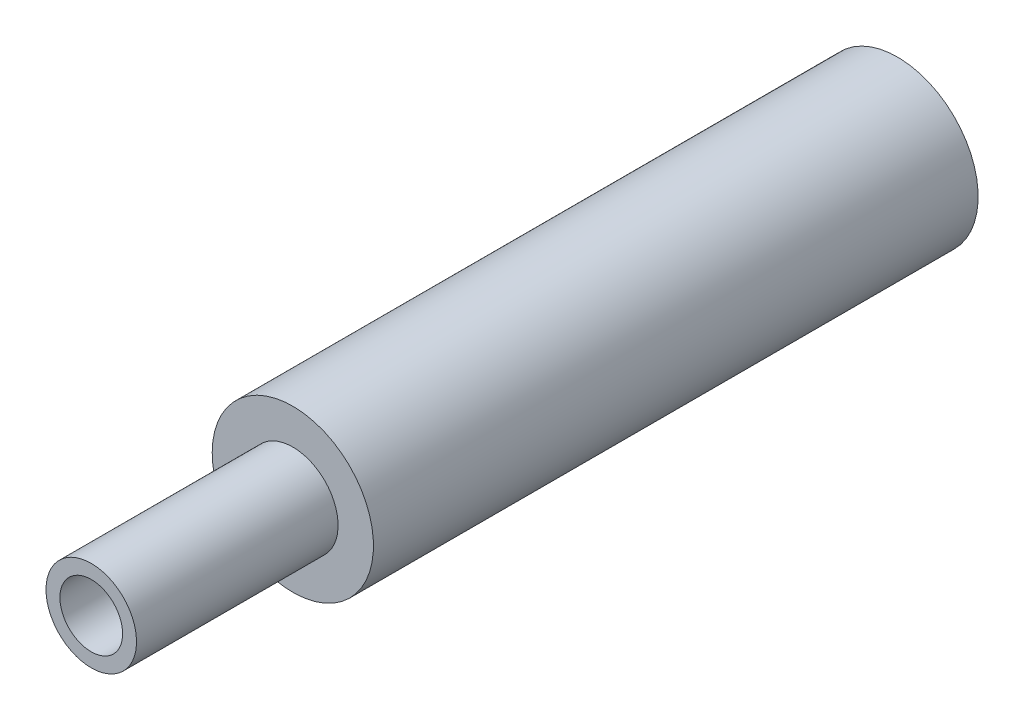
ISO-10303-21;
HEADER;
FILE_DESCRIPTION(('STEP AP214'),'2;1');
FILE_NAME('part.step','',(''),(''),'','','');
FILE_SCHEMA(('AUTOMOTIVE_DESIGN { 1 0 10303 214 1 1 1 1 }'));
ENDSEC;
DATA;
#1=APPLICATION_CONTEXT('core data for automotive mechanical design processes');
#2=APPLICATION_PROTOCOL_DEFINITION('international standard','automotive_design',2000,#1);
#3=PRODUCT_CONTEXT('',#1,'mechanical');
#4=PRODUCT('Part','Part','',(#3));
#5=PRODUCT_RELATED_PRODUCT_CATEGORY('part','',(#4));
#6=PRODUCT_DEFINITION_FORMATION('','',#4);
#7=PRODUCT_DEFINITION_CONTEXT('part definition',#1,'design');
#8=PRODUCT_DEFINITION('design','',#6,#7);
#9=PRODUCT_DEFINITION_SHAPE('','',#8);
#10=(LENGTH_UNIT() NAMED_UNIT(*) SI_UNIT(.MILLI.,.METRE.));
#11=(NAMED_UNIT(*) PLANE_ANGLE_UNIT() SI_UNIT($,.RADIAN.));
#12=(NAMED_UNIT(*) SI_UNIT($,.STERADIAN.) SOLID_ANGLE_UNIT());
#13=UNCERTAINTY_MEASURE_WITH_UNIT(LENGTH_MEASURE(1.E-05),#10,'distance_accuracy_value','');
#14=(GEOMETRIC_REPRESENTATION_CONTEXT(3) GLOBAL_UNCERTAINTY_ASSIGNED_CONTEXT((#13)) GLOBAL_UNIT_ASSIGNED_CONTEXT((#10,
#11,#12)) REPRESENTATION_CONTEXT('',''));
#15=CARTESIAN_POINT('',(0.,0.,0.));
#16=DIRECTION('',(0.,0.,1.));
#17=DIRECTION('',(1.,0.,0.));
#18=AXIS2_PLACEMENT_3D('',#15,#16,#17);
#19=CARTESIAN_POINT('',(0.,0.,20.));
#20=DIRECTION('',(0.,0.,-1.));
#21=DIRECTION('',(-1.,0.,0.));
#22=AXIS2_PLACEMENT_3D('',#19,#20,#21);
#23=CYLINDRICAL_SURFACE('',#22,0.777669256562359);
#24=CARTESIAN_POINT('',(0.,0.,17.));
#25=DIRECTION('',(0.,0.,-1.));
#26=DIRECTION('',(-1.,0.,0.));
#27=AXIS2_PLACEMENT_3D('',#24,#25,#26);
#28=CIRCLE('',#27,0.777669256562359);
#29=CARTESIAN_POINT('',(-0.777669256562359,0.,17.));
#30=VERTEX_POINT('',#29);
#31=EDGE_CURVE('E59',#30,#30,#28,.T.);
#32=ORIENTED_EDGE('',*,*,#31,.T.);
#33=EDGE_LOOP('',(#32));
#34=FACE_BOUND('',#33,.T.);
#35=CARTESIAN_POINT('',(0.,0.,20.));
#36=DIRECTION('',(0.,0.,-1.));
#37=DIRECTION('',(-1.,0.,0.));
#38=AXIS2_PLACEMENT_3D('',#35,#36,#37);
#39=CIRCLE('',#38,0.777669256562359);
#40=CARTESIAN_POINT('',(-0.777669256562359,0.,20.));
#41=VERTEX_POINT('',#40);
#42=EDGE_CURVE('E10',#41,#41,#39,.T.);
#43=ORIENTED_EDGE('',*,*,#42,.F.);
#44=EDGE_LOOP('',(#43));
#45=FACE_BOUND('',#44,.T.);
#46=ADVANCED_FACE('F31',(#34,#45),#23,.F.);
#47=CARTESIAN_POINT('',(1.12260036961182,0.,20.));
#48=DIRECTION('',(0.,0.,1.));
#49=DIRECTION('',(1.,0.,0.));
#50=AXIS2_PLACEMENT_3D('',#47,#48,#49);
#51=PLANE('',#50);
#52=ORIENTED_EDGE('',*,*,#42,.T.);
#53=EDGE_LOOP('',(#52));
#54=FACE_BOUND('',#53,.T.);
#55=CARTESIAN_POINT('',(0.,0.,20.));
#56=DIRECTION('',(0.,0.,-1.));
#57=DIRECTION('',(-1.,0.,0.));
#58=AXIS2_PLACEMENT_3D('',#55,#56,#57);
#59=CIRCLE('',#58,1.12260036961182);
#60=CARTESIAN_POINT('',(-1.12260036961182,0.,20.));
#61=VERTEX_POINT('',#60);
#62=EDGE_CURVE('E37',#61,#61,#59,.T.);
#63=ORIENTED_EDGE('',*,*,#62,.F.);
#64=EDGE_LOOP('',(#63));
#65=FACE_BOUND('',#64,.T.);
#66=ADVANCED_FACE('F76',(#54,#65),#51,.T.);
#67=CARTESIAN_POINT('',(0.,0.,20.));
#68=DIRECTION('',(0.,0.,-1.));
#69=DIRECTION('',(-1.,0.,0.));
#70=AXIS2_PLACEMENT_3D('',#67,#68,#69);
#71=CYLINDRICAL_SURFACE('',#70,1.12260036961182);
#72=ORIENTED_EDGE('',*,*,#62,.T.);
#73=EDGE_LOOP('',(#72));
#74=FACE_BOUND('',#73,.T.);
#75=CARTESIAN_POINT('',(0.,0.,15.));
#76=DIRECTION('',(0.,0.,-1.));
#77=DIRECTION('',(-1.,0.,0.));
#78=AXIS2_PLACEMENT_3D('',#75,#76,#77);
#79=CIRCLE('',#78,1.12260036961182);
#80=CARTESIAN_POINT('',(-1.12260036961182,0.,15.));
#81=VERTEX_POINT('',#80);
#82=EDGE_CURVE('E41',#81,#81,#79,.T.);
#83=ORIENTED_EDGE('',*,*,#82,.F.);
#84=EDGE_LOOP('',(#83));
#85=FACE_BOUND('',#84,.T.);
#86=ADVANCED_FACE('F80',(#74,#85),#71,.T.);
#87=CARTESIAN_POINT('',(2.,0.,15.));
#88=DIRECTION('',(0.,0.,1.));
#89=DIRECTION('',(1.,0.,0.));
#90=AXIS2_PLACEMENT_3D('',#87,#88,#89);
#91=PLANE('',#90);
#92=ORIENTED_EDGE('',*,*,#82,.T.);
#93=EDGE_LOOP('',(#92));
#94=FACE_BOUND('',#93,.T.);
#95=CARTESIAN_POINT('',(0.,0.,15.));
#96=DIRECTION('',(0.,0.,-1.));
#97=DIRECTION('',(-1.,0.,0.));
#98=AXIS2_PLACEMENT_3D('',#95,#96,#97);
#99=CIRCLE('',#98,2.);
#100=CARTESIAN_POINT('',(-2.,0.,15.));
#101=VERTEX_POINT('',#100);
#102=EDGE_CURVE('E45',#101,#101,#99,.T.);
#103=ORIENTED_EDGE('',*,*,#102,.F.);
#104=EDGE_LOOP('',(#103));
#105=FACE_BOUND('',#104,.T.);
#106=ADVANCED_FACE('F84',(#94,#105),#91,.T.);
#107=CARTESIAN_POINT('',(0.,0.,20.));
#108=DIRECTION('',(0.,0.,-1.));
#109=DIRECTION('',(-1.,0.,0.));
#110=AXIS2_PLACEMENT_3D('',#107,#108,#109);
#111=CYLINDRICAL_SURFACE('',#110,2.);
#112=ORIENTED_EDGE('',*,*,#102,.T.);
#113=EDGE_LOOP('',(#112));
#114=FACE_BOUND('',#113,.T.);
#115=CARTESIAN_POINT('',(0.,0.,0.));
#116=DIRECTION('',(0.,0.,-1.));
#117=DIRECTION('',(-1.,0.,0.));
#118=AXIS2_PLACEMENT_3D('',#115,#116,#117);
#119=CIRCLE('',#118,2.);
#120=CARTESIAN_POINT('',(-2.,0.,0.));
#121=VERTEX_POINT('',#120);
#122=EDGE_CURVE('E50',#121,#121,#119,.T.);
#123=ORIENTED_EDGE('',*,*,#122,.F.);
#124=EDGE_LOOP('',(#123));
#125=FACE_BOUND('',#124,.T.);
#126=ADVANCED_FACE('F90',(#114,#125),#111,.T.);
#127=CARTESIAN_POINT('',(1.475,0.,0.));
#128=DIRECTION('',(0.,0.,-1.));
#129=DIRECTION('',(-1.,0.,0.));
#130=AXIS2_PLACEMENT_3D('',#127,#128,#129);
#131=PLANE('',#130);
#132=ORIENTED_EDGE('',*,*,#122,.T.);
#133=EDGE_LOOP('',(#132));
#134=FACE_BOUND('',#133,.T.);
#135=CARTESIAN_POINT('',(0.,0.,0.));
#136=DIRECTION('',(0.,0.,-1.));
#137=DIRECTION('',(-1.,0.,0.));
#138=AXIS2_PLACEMENT_3D('',#135,#136,#137);
#139=CIRCLE('',#138,1.475);
#140=CARTESIAN_POINT('',(-1.475,0.,0.));
#141=VERTEX_POINT('',#140);
#142=EDGE_CURVE('E53',#141,#141,#139,.T.);
#143=ORIENTED_EDGE('',*,*,#142,.F.);
#144=EDGE_LOOP('',(#143));
#145=FACE_BOUND('',#144,.T.);
#146=ADVANCED_FACE('F94',(#134,#145),#131,.T.);
#147=CARTESIAN_POINT('',(0.,0.,20.));
#148=DIRECTION('',(0.,0.,-1.));
#149=DIRECTION('',(-1.,0.,0.));
#150=AXIS2_PLACEMENT_3D('',#147,#148,#149);
#151=CYLINDRICAL_SURFACE('',#150,1.475);
#152=ORIENTED_EDGE('',*,*,#142,.T.);
#153=EDGE_LOOP('',(#152));
#154=FACE_BOUND('',#153,.T.);
#155=CARTESIAN_POINT('',(0.,0.,10.));
#156=DIRECTION('',(0.,0.,-1.));
#157=DIRECTION('',(-1.,0.,0.));
#158=AXIS2_PLACEMENT_3D('',#155,#156,#157);
#159=CIRCLE('',#158,1.475);
#160=CARTESIAN_POINT('',(-1.475,0.,10.));
#161=VERTEX_POINT('',#160);
#162=EDGE_CURVE('E56',#161,#161,#159,.T.);
#163=ORIENTED_EDGE('',*,*,#162,.F.);
#164=EDGE_LOOP('',(#163));
#165=FACE_BOUND('',#164,.T.);
#166=ADVANCED_FACE('F72',(#154,#165),#151,.F.);
#167=CARTESIAN_POINT('',(0.,0.,10.));
#168=DIRECTION('',(0.,0.,-1.));
#169=DIRECTION('',(-1.,0.,0.));
#170=AXIS2_PLACEMENT_3D('',#167,#168,#169);
#171=PLANE('',#170);
#172=ORIENTED_EDGE('',*,*,#162,.T.);
#173=EDGE_LOOP('',(#172));
#174=FACE_BOUND('',#173,.T.);
#175=ADVANCED_FACE('F67',(#174),#171,.T.);
#176=CARTESIAN_POINT('',(0.777669256562359,0.,17.));
#177=DIRECTION('',(0.,0.,1.));
#178=DIRECTION('',(1.,0.,0.));
#179=AXIS2_PLACEMENT_3D('',#176,#177,#178);
#180=PLANE('',#179);
#181=ORIENTED_EDGE('',*,*,#31,.F.);
#182=EDGE_LOOP('',(#181));
#183=FACE_BOUND('',#182,.T.);
#184=ADVANCED_FACE('F65',(#183),#180,.T.);
#185=CLOSED_SHELL('',(#46,#66,#86,#106,#126,#146,#166,#175,#184));
#186=MANIFOLD_SOLID_BREP('B2',#185);
#187=ADVANCED_BREP_SHAPE_REPRESENTATION('',(#18,#186),#14);
#188=SHAPE_DEFINITION_REPRESENTATION(#9,#187);
ENDSEC;
END-ISO-10303-21;
